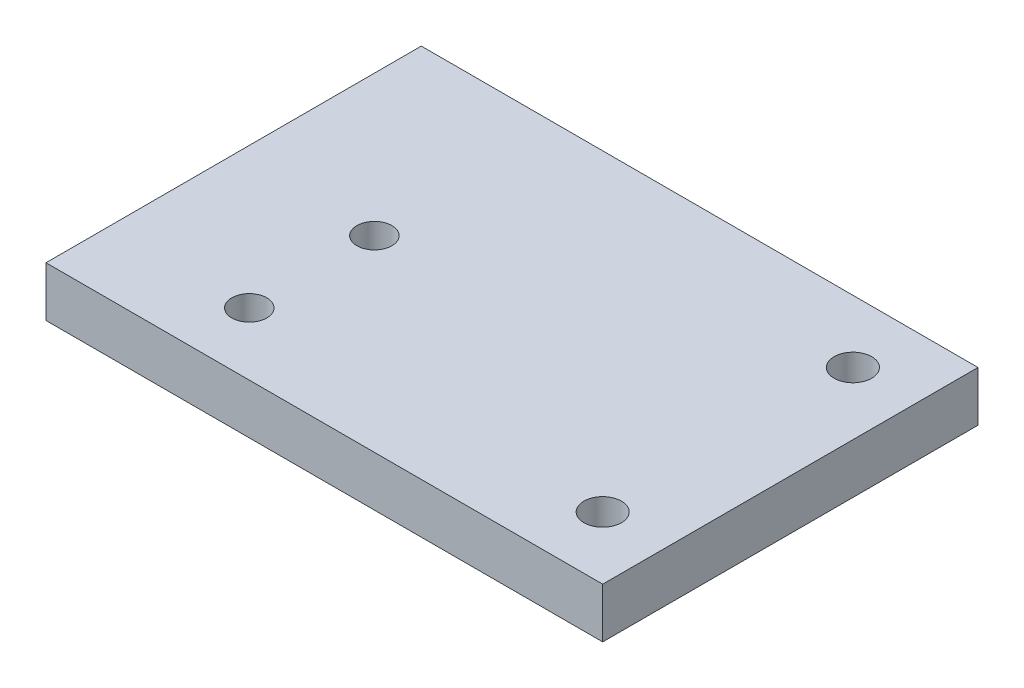
ISO-10303-21;
HEADER;
FILE_DESCRIPTION(('STEP AP214'),'2;1');
FILE_NAME('part.step','',(''),(''),'','','');
FILE_SCHEMA(('AUTOMOTIVE_DESIGN { 1 0 10303 214 1 1 1 1 }'));
ENDSEC;
DATA;
#1=APPLICATION_CONTEXT('core data for automotive mechanical design processes');
#2=APPLICATION_PROTOCOL_DEFINITION('international standard','automotive_design',2000,#1);
#3=PRODUCT_CONTEXT('',#1,'mechanical');
#4=PRODUCT('Part','Part','',(#3));
#5=PRODUCT_RELATED_PRODUCT_CATEGORY('part','',(#4));
#6=PRODUCT_DEFINITION_FORMATION('','',#4);
#7=PRODUCT_DEFINITION_CONTEXT('part definition',#1,'design');
#8=PRODUCT_DEFINITION('design','',#6,#7);
#9=PRODUCT_DEFINITION_SHAPE('','',#8);
#10=(LENGTH_UNIT() NAMED_UNIT(*) SI_UNIT(.MILLI.,.METRE.));
#11=(NAMED_UNIT(*) PLANE_ANGLE_UNIT() SI_UNIT($,.RADIAN.));
#12=(NAMED_UNIT(*) SI_UNIT($,.STERADIAN.) SOLID_ANGLE_UNIT());
#13=UNCERTAINTY_MEASURE_WITH_UNIT(LENGTH_MEASURE(1.E-05),#10,'distance_accuracy_value','');
#14=(GEOMETRIC_REPRESENTATION_CONTEXT(3) GLOBAL_UNCERTAINTY_ASSIGNED_CONTEXT((#13)) GLOBAL_UNIT_ASSIGNED_CONTEXT((#10,
#11,#12)) REPRESENTATION_CONTEXT('',''));
#15=CARTESIAN_POINT('',(0.,0.,0.));
#16=DIRECTION('',(0.,0.,1.));
#17=DIRECTION('',(1.,0.,0.));
#18=AXIS2_PLACEMENT_3D('',#15,#16,#17);
#19=CARTESIAN_POINT('',(0.,4.,0.));
#20=DIRECTION('',(-1.,0.,0.));
#21=DIRECTION('',(0.,0.,1.));
#22=AXIS2_PLACEMENT_3D('',#19,#20,#21);
#23=PLANE('',#22);
#24=DIRECTION('',(0.,0.,-1.));
#25=VECTOR('',#24,1.);
#26=CARTESIAN_POINT('',(0.,0.,0.));
#27=LINE('',#26,#25);
#28=CARTESIAN_POINT('',(0.,0.,0.));
#29=VERTEX_POINT('',#28);
#30=CARTESIAN_POINT('',(0.,0.,-30.));
#31=VERTEX_POINT('',#30);
#32=EDGE_CURVE('E125',#29,#31,#27,.T.);
#33=ORIENTED_EDGE('',*,*,#32,.F.);
#34=DIRECTION('',(0.,-1.,0.));
#35=VECTOR('',#34,1.);
#36=CARTESIAN_POINT('',(0.,4.,0.));
#37=LINE('',#36,#35);
#38=CARTESIAN_POINT('',(0.,4.,0.));
#39=VERTEX_POINT('',#38);
#40=EDGE_CURVE('E11',#39,#29,#37,.T.);
#41=ORIENTED_EDGE('',*,*,#40,.F.);
#42=DIRECTION('',(0.,0.,-1.));
#43=VECTOR('',#42,1.);
#44=CARTESIAN_POINT('',(0.,4.,0.));
#45=LINE('',#44,#43);
#46=CARTESIAN_POINT('',(0.,4.,-30.));
#47=VERTEX_POINT('',#46);
#48=EDGE_CURVE('E99',#39,#47,#45,.T.);
#49=ORIENTED_EDGE('',*,*,#48,.T.);
#50=DIRECTION('',(0.,-1.,0.));
#51=VECTOR('',#50,1.);
#52=CARTESIAN_POINT('',(0.,4.,-30.));
#53=LINE('',#52,#51);
#54=EDGE_CURVE('E79',#47,#31,#53,.T.);
#55=ORIENTED_EDGE('',*,*,#54,.T.);
#56=EDGE_LOOP('',(#33,#41,#49,#55));
#57=FACE_BOUND('',#56,.T.);
#58=ADVANCED_FACE('F39',(#57),#23,.T.);
#59=CARTESIAN_POINT('',(0.,4.,0.));
#60=DIRECTION('',(0.,0.,1.));
#61=DIRECTION('',(1.,0.,0.));
#62=AXIS2_PLACEMENT_3D('',#59,#60,#61);
#63=PLANE('',#62);
#64=DIRECTION('',(-1.,0.,0.));
#65=VECTOR('',#64,1.);
#66=CARTESIAN_POINT('',(0.,0.,0.));
#67=LINE('',#66,#65);
#68=CARTESIAN_POINT('',(44.5,0.,0.));
#69=VERTEX_POINT('',#68);
#70=EDGE_CURVE('E90',#69,#29,#67,.T.);
#71=ORIENTED_EDGE('',*,*,#70,.F.);
#72=DIRECTION('',(0.,-1.,0.));
#73=VECTOR('',#72,1.);
#74=CARTESIAN_POINT('',(44.5,4.,0.));
#75=LINE('',#74,#73);
#76=CARTESIAN_POINT('',(44.5,4.,0.));
#77=VERTEX_POINT('',#76);
#78=EDGE_CURVE('E49',#77,#69,#75,.T.);
#79=ORIENTED_EDGE('',*,*,#78,.F.);
#80=DIRECTION('',(-1.,0.,0.));
#81=VECTOR('',#80,1.);
#82=CARTESIAN_POINT('',(0.,4.,0.));
#83=LINE('',#82,#81);
#84=EDGE_CURVE('E88',#77,#39,#83,.T.);
#85=ORIENTED_EDGE('',*,*,#84,.T.);
#86=ORIENTED_EDGE('',*,*,#40,.T.);
#87=EDGE_LOOP('',(#71,#79,#85,#86));
#88=FACE_BOUND('',#87,.T.);
#89=ADVANCED_FACE('F87',(#88),#63,.T.);
#90=CARTESIAN_POINT('',(44.5,4.,0.));
#91=DIRECTION('',(1.,0.,0.));
#92=DIRECTION('',(0.,0.,-1.));
#93=AXIS2_PLACEMENT_3D('',#90,#91,#92);
#94=PLANE('',#93);
#95=DIRECTION('',(0.,0.,1.));
#96=VECTOR('',#95,1.);
#97=CARTESIAN_POINT('',(44.5,0.,0.));
#98=LINE('',#97,#96);
#99=CARTESIAN_POINT('',(44.5,0.,-30.));
#100=VERTEX_POINT('',#99);
#101=EDGE_CURVE('E131',#100,#69,#98,.T.);
#102=ORIENTED_EDGE('',*,*,#101,.F.);
#103=DIRECTION('',(0.,-1.,0.));
#104=VECTOR('',#103,1.);
#105=CARTESIAN_POINT('',(44.5,4.,-30.));
#106=LINE('',#105,#104);
#107=CARTESIAN_POINT('',(44.5,4.,-30.));
#108=VERTEX_POINT('',#107);
#109=EDGE_CURVE('E72',#108,#100,#106,.T.);
#110=ORIENTED_EDGE('',*,*,#109,.F.);
#111=DIRECTION('',(0.,0.,1.));
#112=VECTOR('',#111,1.);
#113=CARTESIAN_POINT('',(44.5,4.,0.));
#114=LINE('',#113,#112);
#115=EDGE_CURVE('E98',#108,#77,#114,.T.);
#116=ORIENTED_EDGE('',*,*,#115,.T.);
#117=ORIENTED_EDGE('',*,*,#78,.T.);
#118=EDGE_LOOP('',(#102,#110,#116,#117));
#119=FACE_BOUND('',#118,.T.);
#120=ADVANCED_FACE('F102',(#119),#94,.T.);
#121=CARTESIAN_POINT('',(39.5,4.,-5.));
#122=DIRECTION('',(0.,-1.,0.));
#123=DIRECTION('',(0.,0.,-1.));
#124=AXIS2_PLACEMENT_3D('',#121,#122,#123);
#125=CYLINDRICAL_SURFACE('',#124,1.5);
#126=CARTESIAN_POINT('',(39.5,4.,-5.));
#127=DIRECTION('',(0.,1.,0.));
#128=DIRECTION('',(0.,0.,1.));
#129=AXIS2_PLACEMENT_3D('',#126,#127,#128);
#130=CIRCLE('',#129,1.5);
#131=CARTESIAN_POINT('',(39.5,4.,-3.5));
#132=VERTEX_POINT('',#131);
#133=EDGE_CURVE('E106',#132,#132,#130,.T.);
#134=ORIENTED_EDGE('',*,*,#133,.T.);
#135=EDGE_LOOP('',(#134));
#136=FACE_BOUND('',#135,.T.);
#137=CARTESIAN_POINT('',(39.5,0.,-5.));
#138=DIRECTION('',(0.,1.,0.));
#139=DIRECTION('',(0.,0.,1.));
#140=AXIS2_PLACEMENT_3D('',#137,#138,#139);
#141=CIRCLE('',#140,1.5);
#142=CARTESIAN_POINT('',(39.5,0.,-3.5));
#143=VERTEX_POINT('',#142);
#144=EDGE_CURVE('E137',#143,#143,#141,.T.);
#145=ORIENTED_EDGE('',*,*,#144,.F.);
#146=EDGE_LOOP('',(#145));
#147=FACE_BOUND('',#146,.T.);
#148=ADVANCED_FACE('F177',(#136,#147),#125,.F.);
#149=CARTESIAN_POINT('',(0.,4.,-30.));
#150=DIRECTION('',(0.,0.,1.));
#151=DIRECTION('',(1.,0.,0.));
#152=AXIS2_PLACEMENT_3D('',#149,#150,#151);
#153=PLANE('',#152);
#154=DIRECTION('',(-1.,0.,0.));
#155=VECTOR('',#154,1.);
#156=CARTESIAN_POINT('',(0.,0.,-30.));
#157=LINE('',#156,#155);
#158=EDGE_CURVE('E134',#100,#31,#157,.T.);
#159=ORIENTED_EDGE('',*,*,#158,.T.);
#160=ORIENTED_EDGE('',*,*,#54,.F.);
#161=DIRECTION('',(-1.,0.,0.));
#162=VECTOR('',#161,1.);
#163=CARTESIAN_POINT('',(0.,4.,-30.));
#164=LINE('',#163,#162);
#165=EDGE_CURVE('E57',#108,#47,#164,.T.);
#166=ORIENTED_EDGE('',*,*,#165,.F.);
#167=ORIENTED_EDGE('',*,*,#109,.T.);
#168=EDGE_LOOP('',(#159,#160,#166,#167));
#169=FACE_BOUND('',#168,.T.);
#170=ADVANCED_FACE('F170',(#169),#153,.F.);
#171=CARTESIAN_POINT('',(11.25,4.,-15.));
#172=DIRECTION('',(0.,-1.,0.));
#173=DIRECTION('',(0.,0.,-1.));
#174=AXIS2_PLACEMENT_3D('',#171,#172,#173);
#175=CYLINDRICAL_SURFACE('',#174,1.4);
#176=CARTESIAN_POINT('',(11.25,4.,-15.));
#177=DIRECTION('',(0.,1.,0.));
#178=DIRECTION('',(0.,0.,1.));
#179=AXIS2_PLACEMENT_3D('',#176,#177,#178);
#180=CIRCLE('',#179,1.4);
#181=CARTESIAN_POINT('',(11.25,4.,-13.6));
#182=VERTEX_POINT('',#181);
#183=EDGE_CURVE('E153',#182,#182,#180,.T.);
#184=ORIENTED_EDGE('',*,*,#183,.T.);
#185=EDGE_LOOP('',(#184));
#186=FACE_BOUND('',#185,.T.);
#187=CARTESIAN_POINT('',(11.25,0.,-15.));
#188=DIRECTION('',(0.,1.,0.));
#189=DIRECTION('',(0.,0.,1.));
#190=AXIS2_PLACEMENT_3D('',#187,#188,#189);
#191=CIRCLE('',#190,1.4);
#192=CARTESIAN_POINT('',(11.25,0.,-13.6));
#193=VERTEX_POINT('',#192);
#194=EDGE_CURVE('E121',#193,#193,#191,.T.);
#195=ORIENTED_EDGE('',*,*,#194,.F.);
#196=EDGE_LOOP('',(#195));
#197=FACE_BOUND('',#196,.T.);
#198=ADVANCED_FACE('F168',(#186,#197),#175,.F.);
#199=CARTESIAN_POINT('',(11.25,4.,-5.));
#200=DIRECTION('',(0.,-1.,0.));
#201=DIRECTION('',(0.,0.,-1.));
#202=AXIS2_PLACEMENT_3D('',#199,#200,#201);
#203=CYLINDRICAL_SURFACE('',#202,1.4);
#204=CARTESIAN_POINT('',(11.25,4.,-5.));
#205=DIRECTION('',(0.,1.,0.));
#206=DIRECTION('',(0.,0.,1.));
#207=AXIS2_PLACEMENT_3D('',#204,#205,#206);
#208=CIRCLE('',#207,1.4);
#209=CARTESIAN_POINT('',(11.25,4.,-3.60000000000001));
#210=VERTEX_POINT('',#209);
#211=EDGE_CURVE('E145',#210,#210,#208,.T.);
#212=ORIENTED_EDGE('',*,*,#211,.T.);
#213=EDGE_LOOP('',(#212));
#214=FACE_BOUND('',#213,.T.);
#215=CARTESIAN_POINT('',(11.25,0.,-5.));
#216=DIRECTION('',(0.,1.,0.));
#217=DIRECTION('',(0.,0.,1.));
#218=AXIS2_PLACEMENT_3D('',#215,#216,#217);
#219=CIRCLE('',#218,1.4);
#220=CARTESIAN_POINT('',(11.25,0.,-3.60000000000001));
#221=VERTEX_POINT('',#220);
#222=EDGE_CURVE('E117',#221,#221,#219,.T.);
#223=ORIENTED_EDGE('',*,*,#222,.F.);
#224=EDGE_LOOP('',(#223));
#225=FACE_BOUND('',#224,.T.);
#226=ADVANCED_FACE('F41',(#214,#225),#203,.F.);
#227=CARTESIAN_POINT('',(39.5,4.,-25.));
#228=DIRECTION('',(0.,-1.,0.));
#229=DIRECTION('',(0.,0.,-1.));
#230=AXIS2_PLACEMENT_3D('',#227,#228,#229);
#231=CYLINDRICAL_SURFACE('',#230,1.5);
#232=CARTESIAN_POINT('',(39.5,4.,-25.));
#233=DIRECTION('',(0.,1.,0.));
#234=DIRECTION('',(0.,0.,1.));
#235=AXIS2_PLACEMENT_3D('',#232,#233,#234);
#236=CIRCLE('',#235,1.5);
#237=CARTESIAN_POINT('',(39.5,4.,-23.5));
#238=VERTEX_POINT('',#237);
#239=EDGE_CURVE('E113',#238,#238,#236,.T.);
#240=ORIENTED_EDGE('',*,*,#239,.T.);
#241=EDGE_LOOP('',(#240));
#242=FACE_BOUND('',#241,.T.);
#243=CARTESIAN_POINT('',(39.5,0.,-25.));
#244=DIRECTION('',(0.,1.,0.));
#245=DIRECTION('',(0.,0.,1.));
#246=AXIS2_PLACEMENT_3D('',#243,#244,#245);
#247=CIRCLE('',#246,1.5);
#248=CARTESIAN_POINT('',(39.5,0.,-23.5));
#249=VERTEX_POINT('',#248);
#250=EDGE_CURVE('E141',#249,#249,#247,.T.);
#251=ORIENTED_EDGE('',*,*,#250,.F.);
#252=EDGE_LOOP('',(#251));
#253=FACE_BOUND('',#252,.T.);
#254=ADVANCED_FACE('F176',(#242,#253),#231,.F.);
#255=CARTESIAN_POINT('',(0.,4.,0.));
#256=DIRECTION('',(0.,1.,0.));
#257=DIRECTION('',(0.,0.,1.));
#258=AXIS2_PLACEMENT_3D('',#255,#256,#257);
#259=PLANE('',#258);
#260=ORIENTED_EDGE('',*,*,#211,.F.);
#261=EDGE_LOOP('',(#260));
#262=FACE_BOUND('',#261,.T.);
#263=ORIENTED_EDGE('',*,*,#183,.F.);
#264=EDGE_LOOP('',(#263));
#265=FACE_BOUND('',#264,.T.);
#266=ORIENTED_EDGE('',*,*,#48,.F.);
#267=ORIENTED_EDGE('',*,*,#84,.F.);
#268=ORIENTED_EDGE('',*,*,#115,.F.);
#269=ORIENTED_EDGE('',*,*,#165,.T.);
#270=EDGE_LOOP('',(#266,#267,#268,#269));
#271=FACE_BOUND('',#270,.T.);
#272=ORIENTED_EDGE('',*,*,#133,.F.);
#273=EDGE_LOOP('',(#272));
#274=FACE_BOUND('',#273,.T.);
#275=ORIENTED_EDGE('',*,*,#239,.F.);
#276=EDGE_LOOP('',(#275));
#277=FACE_BOUND('',#276,.T.);
#278=ADVANCED_FACE('F96',(#262,#265,#271,#274,#277),#259,.T.);
#279=CARTESIAN_POINT('',(0.,0.,0.));
#280=DIRECTION('',(0.,1.,0.));
#281=DIRECTION('',(0.,0.,1.));
#282=AXIS2_PLACEMENT_3D('',#279,#280,#281);
#283=PLANE('',#282);
#284=ORIENTED_EDGE('',*,*,#222,.T.);
#285=EDGE_LOOP('',(#284));
#286=FACE_BOUND('',#285,.T.);
#287=ORIENTED_EDGE('',*,*,#194,.T.);
#288=EDGE_LOOP('',(#287));
#289=FACE_BOUND('',#288,.T.);
#290=ORIENTED_EDGE('',*,*,#32,.T.);
#291=ORIENTED_EDGE('',*,*,#158,.F.);
#292=ORIENTED_EDGE('',*,*,#101,.T.);
#293=ORIENTED_EDGE('',*,*,#70,.T.);
#294=EDGE_LOOP('',(#290,#291,#292,#293));
#295=FACE_BOUND('',#294,.T.);
#296=ORIENTED_EDGE('',*,*,#144,.T.);
#297=EDGE_LOOP('',(#296));
#298=FACE_BOUND('',#297,.T.);
#299=ORIENTED_EDGE('',*,*,#250,.T.);
#300=EDGE_LOOP('',(#299));
#301=FACE_BOUND('',#300,.T.);
#302=ADVANCED_FACE('F183',(#286,#289,#295,#298,#301),#283,.F.);
#303=CLOSED_SHELL('',(#58,#89,#120,#148,#170,#198,#226,#254,#278,#302));
#304=MANIFOLD_SOLID_BREP('B2',#303);
#305=ADVANCED_BREP_SHAPE_REPRESENTATION('',(#18,#304),#14);
#306=SHAPE_DEFINITION_REPRESENTATION(#9,#305);
ENDSEC;
END-ISO-10303-21;
